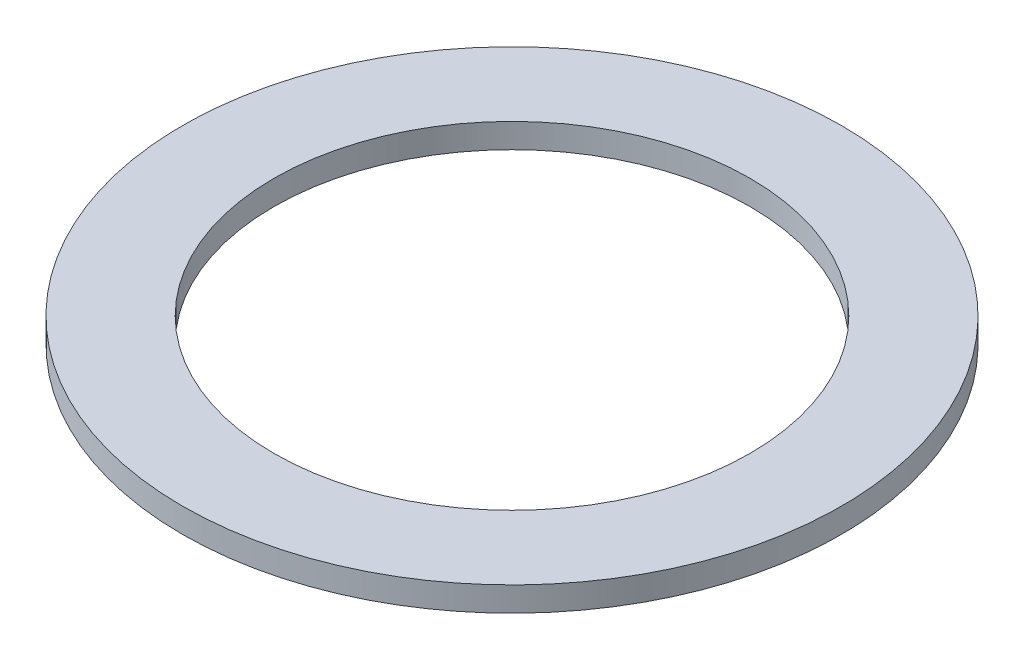
ISO-10303-21;
HEADER;
FILE_DESCRIPTION(('STEP AP214'),'2;1');
FILE_NAME('part.step','',(''),(''),'','','');
FILE_SCHEMA(('AUTOMOTIVE_DESIGN { 1 0 10303 214 1 1 1 1 }'));
ENDSEC;
DATA;
#1=APPLICATION_CONTEXT('core data for automotive mechanical design processes');
#2=APPLICATION_PROTOCOL_DEFINITION('international standard','automotive_design',2000,#1);
#3=PRODUCT_CONTEXT('',#1,'mechanical');
#4=PRODUCT('Part','Part','',(#3));
#5=PRODUCT_RELATED_PRODUCT_CATEGORY('part','',(#4));
#6=PRODUCT_DEFINITION_FORMATION('','',#4);
#7=PRODUCT_DEFINITION_CONTEXT('part definition',#1,'design');
#8=PRODUCT_DEFINITION('design','',#6,#7);
#9=PRODUCT_DEFINITION_SHAPE('','',#8);
#10=(LENGTH_UNIT() NAMED_UNIT(*) SI_UNIT(.MILLI.,.METRE.));
#11=(NAMED_UNIT(*) PLANE_ANGLE_UNIT() SI_UNIT($,.RADIAN.));
#12=(NAMED_UNIT(*) SI_UNIT($,.STERADIAN.) SOLID_ANGLE_UNIT());
#13=UNCERTAINTY_MEASURE_WITH_UNIT(LENGTH_MEASURE(1.E-05),#10,'distance_accuracy_value','');
#14=(GEOMETRIC_REPRESENTATION_CONTEXT(3) GLOBAL_UNCERTAINTY_ASSIGNED_CONTEXT((#13)) GLOBAL_UNIT_ASSIGNED_CONTEXT((#10,
#11,#12)) REPRESENTATION_CONTEXT('',''));
#15=CARTESIAN_POINT('',(0.,0.,0.));
#16=DIRECTION('',(0.,0.,1.));
#17=DIRECTION('',(1.,0.,0.));
#18=AXIS2_PLACEMENT_3D('',#15,#16,#17);
#19=CARTESIAN_POINT('',(0.,0.195231468618644,0.));
#20=DIRECTION('',(0.,-1.,0.));
#21=DIRECTION('',(0.,0.,-1.));
#22=AXIS2_PLACEMENT_3D('',#19,#20,#21);
#23=CYLINDRICAL_SURFACE('',#22,19.4945);
#24=CARTESIAN_POINT('',(0.,0.,0.));
#25=DIRECTION('',(0.,-1.,0.));
#26=DIRECTION('',(0.,0.,-1.));
#27=AXIS2_PLACEMENT_3D('',#24,#25,#26);
#28=CIRCLE('',#27,19.4945);
#29=CARTESIAN_POINT('',(0.,0.,-19.4945));
#30=VERTEX_POINT('',#29);
#31=EDGE_CURVE('E10',#30,#30,#28,.T.);
#32=ORIENTED_EDGE('',*,*,#31,.T.);
#33=EDGE_LOOP('',(#32));
#34=FACE_BOUND('',#33,.T.);
#35=CARTESIAN_POINT('',(0.,2.0066,0.));
#36=DIRECTION('',(0.,-1.,0.));
#37=DIRECTION('',(0.,0.,-1.));
#38=AXIS2_PLACEMENT_3D('',#35,#36,#37);
#39=CIRCLE('',#38,19.4945);
#40=CARTESIAN_POINT('',(0.,2.0066,-19.4945));
#41=VERTEX_POINT('',#40);
#42=EDGE_CURVE('E58',#41,#41,#39,.T.);
#43=ORIENTED_EDGE('',*,*,#42,.F.);
#44=EDGE_LOOP('',(#43));
#45=FACE_BOUND('',#44,.T.);
#46=ADVANCED_FACE('F41',(#34,#45),#23,.F.);
#47=CARTESIAN_POINT('',(19.4945,0.,0.));
#48=DIRECTION('',(0.,-1.,0.));
#49=DIRECTION('',(0.,0.,-1.));
#50=AXIS2_PLACEMENT_3D('',#47,#48,#49);
#51=PLANE('',#50);
#52=CARTESIAN_POINT('',(0.,0.,0.));
#53=DIRECTION('',(0.,-1.,0.));
#54=DIRECTION('',(0.,0.,-1.));
#55=AXIS2_PLACEMENT_3D('',#52,#53,#54);
#56=CIRCLE('',#55,26.9748);
#57=CARTESIAN_POINT('',(0.,0.,-26.9748));
#58=VERTEX_POINT('',#57);
#59=EDGE_CURVE('E48',#58,#58,#56,.T.);
#60=ORIENTED_EDGE('',*,*,#59,.T.);
#61=EDGE_LOOP('',(#60));
#62=FACE_BOUND('',#61,.T.);
#63=ORIENTED_EDGE('',*,*,#31,.F.);
#64=EDGE_LOOP('',(#63));
#65=FACE_BOUND('',#64,.T.);
#66=ADVANCED_FACE('F69',(#62,#65),#51,.T.);
#67=CARTESIAN_POINT('',(0.,0.195231468618644,0.));
#68=DIRECTION('',(0.,-1.,0.));
#69=DIRECTION('',(0.,0.,-1.));
#70=AXIS2_PLACEMENT_3D('',#67,#68,#69);
#71=CYLINDRICAL_SURFACE('',#70,26.9748);
#72=CARTESIAN_POINT('',(0.,2.0066,0.));
#73=DIRECTION('',(0.,-1.,0.));
#74=DIRECTION('',(0.,0.,-1.));
#75=AXIS2_PLACEMENT_3D('',#72,#73,#74);
#76=CIRCLE('',#75,26.9748);
#77=CARTESIAN_POINT('',(0.,2.0066,-26.9748));
#78=VERTEX_POINT('',#77);
#79=EDGE_CURVE('E53',#78,#78,#76,.T.);
#80=ORIENTED_EDGE('',*,*,#79,.T.);
#81=EDGE_LOOP('',(#80));
#82=FACE_BOUND('',#81,.T.);
#83=ORIENTED_EDGE('',*,*,#59,.F.);
#84=EDGE_LOOP('',(#83));
#85=FACE_BOUND('',#84,.T.);
#86=ADVANCED_FACE('F73',(#82,#85),#71,.T.);
#87=CARTESIAN_POINT('',(19.4945,2.0066,0.));
#88=DIRECTION('',(0.,1.,0.));
#89=DIRECTION('',(0.,0.,1.));
#90=AXIS2_PLACEMENT_3D('',#87,#88,#89);
#91=PLANE('',#90);
#92=ORIENTED_EDGE('',*,*,#42,.T.);
#93=EDGE_LOOP('',(#92));
#94=FACE_BOUND('',#93,.T.);
#95=ORIENTED_EDGE('',*,*,#79,.F.);
#96=EDGE_LOOP('',(#95));
#97=FACE_BOUND('',#96,.T.);
#98=ADVANCED_FACE('F65',(#94,#97),#91,.T.);
#99=CLOSED_SHELL('',(#46,#66,#86,#98));
#100=MANIFOLD_SOLID_BREP('B2',#99);
#101=ADVANCED_BREP_SHAPE_REPRESENTATION('',(#18,#100),#14);
#102=SHAPE_DEFINITION_REPRESENTATION(#9,#101);
ENDSEC;
END-ISO-10303-21;
